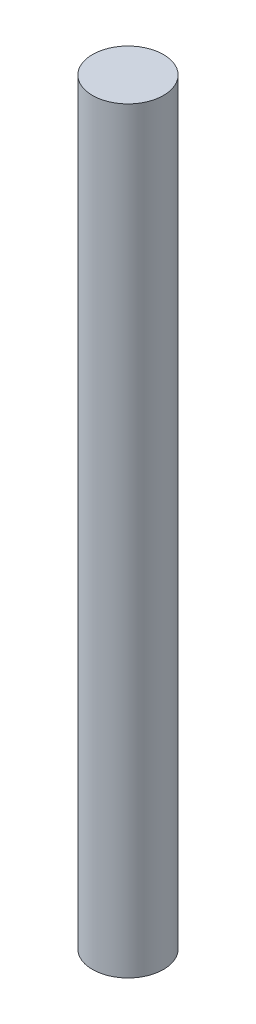
ISO-10303-21;
HEADER;
FILE_DESCRIPTION(('STEP AP214'),'2;1');
FILE_NAME('part.step','',(''),(''),'','','');
FILE_SCHEMA(('AUTOMOTIVE_DESIGN { 1 0 10303 214 1 1 1 1 }'));
ENDSEC;
DATA;
#1=APPLICATION_CONTEXT('core data for automotive mechanical design processes');
#2=APPLICATION_PROTOCOL_DEFINITION('international standard','automotive_design',2000,#1);
#3=PRODUCT_CONTEXT('',#1,'mechanical');
#4=PRODUCT('Part','Part','',(#3));
#5=PRODUCT_RELATED_PRODUCT_CATEGORY('part','',(#4));
#6=PRODUCT_DEFINITION_FORMATION('','',#4);
#7=PRODUCT_DEFINITION_CONTEXT('part definition',#1,'design');
#8=PRODUCT_DEFINITION('design','',#6,#7);
#9=PRODUCT_DEFINITION_SHAPE('','',#8);
#10=(LENGTH_UNIT() NAMED_UNIT(*) SI_UNIT(.MILLI.,.METRE.));
#11=(NAMED_UNIT(*) PLANE_ANGLE_UNIT() SI_UNIT($,.RADIAN.));
#12=(NAMED_UNIT(*) SI_UNIT($,.STERADIAN.) SOLID_ANGLE_UNIT());
#13=UNCERTAINTY_MEASURE_WITH_UNIT(LENGTH_MEASURE(1.E-05),#10,'distance_accuracy_value','');
#14=(GEOMETRIC_REPRESENTATION_CONTEXT(3) GLOBAL_UNCERTAINTY_ASSIGNED_CONTEXT((#13)) GLOBAL_UNIT_ASSIGNED_CONTEXT((#10,
#11,#12)) REPRESENTATION_CONTEXT('',''));
#15=CARTESIAN_POINT('',(0.,0.,0.));
#16=DIRECTION('',(0.,0.,1.));
#17=DIRECTION('',(1.,0.,0.));
#18=AXIS2_PLACEMENT_3D('',#15,#16,#17);
#19=CARTESIAN_POINT('',(0.,50.8,0.));
#20=DIRECTION('',(0.,-1.,0.));
#21=DIRECTION('',(0.,0.,-1.));
#22=AXIS2_PLACEMENT_3D('',#19,#20,#21);
#23=CYLINDRICAL_SURFACE('',#22,2.38125);
#24=CARTESIAN_POINT('',(0.,50.8,0.));
#25=DIRECTION('',(0.,1.,0.));
#26=DIRECTION('',(0.,0.,1.));
#27=AXIS2_PLACEMENT_3D('',#24,#25,#26);
#28=CIRCLE('',#27,2.38125);
#29=CARTESIAN_POINT('',(0.,50.8,2.38125));
#30=VERTEX_POINT('',#29);
#31=EDGE_CURVE('E10',#30,#30,#28,.T.);
#32=ORIENTED_EDGE('',*,*,#31,.F.);
#33=EDGE_LOOP('',(#32));
#34=FACE_BOUND('',#33,.T.);
#35=CARTESIAN_POINT('',(0.,0.,0.));
#36=DIRECTION('',(0.,1.,0.));
#37=DIRECTION('',(0.,0.,1.));
#38=AXIS2_PLACEMENT_3D('',#35,#36,#37);
#39=CIRCLE('',#38,2.38125);
#40=CARTESIAN_POINT('',(0.,0.,2.38125));
#41=VERTEX_POINT('',#40);
#42=EDGE_CURVE('E34',#41,#41,#39,.T.);
#43=ORIENTED_EDGE('',*,*,#42,.T.);
#44=EDGE_LOOP('',(#43));
#45=FACE_BOUND('',#44,.T.);
#46=ADVANCED_FACE('F31',(#34,#45),#23,.T.);
#47=CARTESIAN_POINT('',(0.,50.8,0.));
#48=DIRECTION('',(0.,1.,0.));
#49=DIRECTION('',(0.,0.,1.));
#50=AXIS2_PLACEMENT_3D('',#47,#48,#49);
#51=PLANE('',#50);
#52=ORIENTED_EDGE('',*,*,#31,.T.);
#53=EDGE_LOOP('',(#52));
#54=FACE_BOUND('',#53,.T.);
#55=ADVANCED_FACE('F46',(#54),#51,.T.);
#56=CARTESIAN_POINT('',(0.,0.,0.));
#57=DIRECTION('',(0.,1.,0.));
#58=DIRECTION('',(0.,0.,1.));
#59=AXIS2_PLACEMENT_3D('',#56,#57,#58);
#60=PLANE('',#59);
#61=ORIENTED_EDGE('',*,*,#42,.F.);
#62=EDGE_LOOP('',(#61));
#63=FACE_BOUND('',#62,.T.);
#64=ADVANCED_FACE('F44',(#63),#60,.F.);
#65=CLOSED_SHELL('',(#46,#55,#64));
#66=MANIFOLD_SOLID_BREP('B2',#65);
#67=ADVANCED_BREP_SHAPE_REPRESENTATION('',(#18,#66),#14);
#68=SHAPE_DEFINITION_REPRESENTATION(#9,#67);
ENDSEC;
END-ISO-10303-21;
